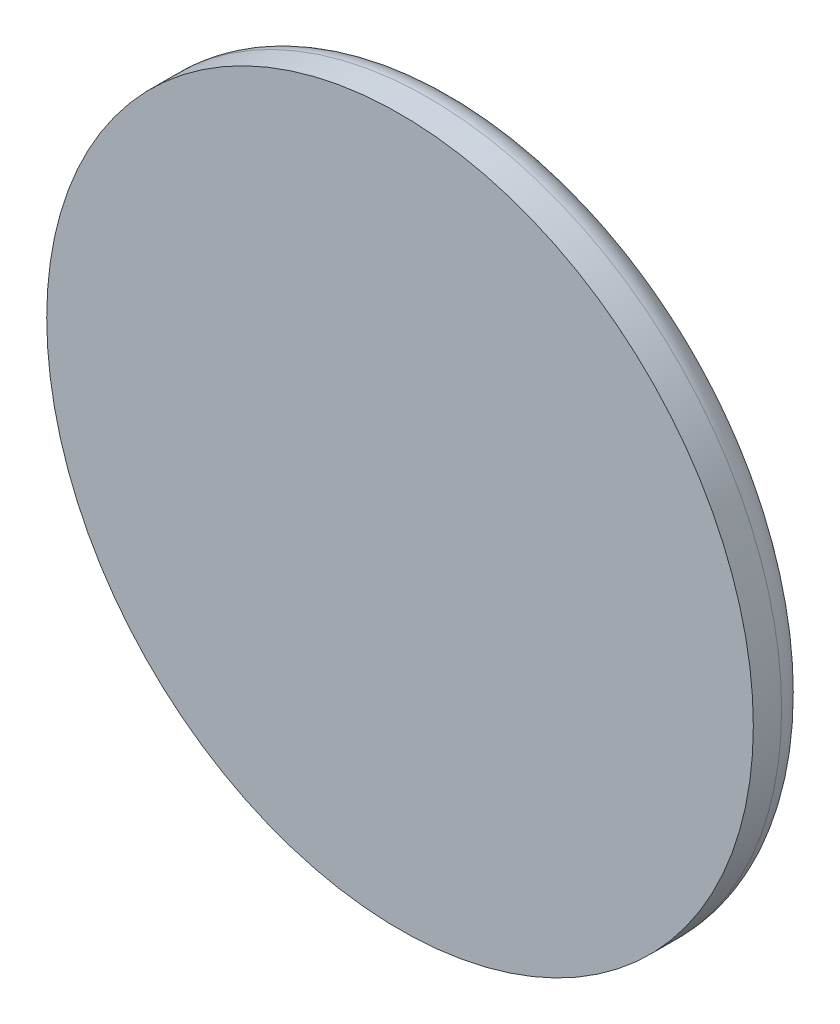
ISO-10303-21;
HEADER;
FILE_DESCRIPTION(('STEP AP214'),'2;1');
FILE_NAME('part.step','',(''),(''),'','','');
FILE_SCHEMA(('AUTOMOTIVE_DESIGN { 1 0 10303 214 1 1 1 1 }'));
ENDSEC;
DATA;
#1=APPLICATION_CONTEXT('core data for automotive mechanical design processes');
#2=APPLICATION_PROTOCOL_DEFINITION('international standard','automotive_design',2000,#1);
#3=PRODUCT_CONTEXT('',#1,'mechanical');
#4=PRODUCT('Part','Part','',(#3));
#5=PRODUCT_RELATED_PRODUCT_CATEGORY('part','',(#4));
#6=PRODUCT_DEFINITION_FORMATION('','',#4);
#7=PRODUCT_DEFINITION_CONTEXT('part definition',#1,'design');
#8=PRODUCT_DEFINITION('design','',#6,#7);
#9=PRODUCT_DEFINITION_SHAPE('','',#8);
#10=(LENGTH_UNIT() NAMED_UNIT(*) SI_UNIT(.MILLI.,.METRE.));
#11=(NAMED_UNIT(*) PLANE_ANGLE_UNIT() SI_UNIT($,.RADIAN.));
#12=(NAMED_UNIT(*) SI_UNIT($,.STERADIAN.) SOLID_ANGLE_UNIT());
#13=UNCERTAINTY_MEASURE_WITH_UNIT(LENGTH_MEASURE(1.E-05),#10,'distance_accuracy_value','');
#14=(GEOMETRIC_REPRESENTATION_CONTEXT(3) GLOBAL_UNCERTAINTY_ASSIGNED_CONTEXT((#13)) GLOBAL_UNIT_ASSIGNED_CONTEXT((#10,
#11,#12)) REPRESENTATION_CONTEXT('',''));
#15=CARTESIAN_POINT('',(0.,0.,0.));
#16=DIRECTION('',(0.,0.,1.));
#17=DIRECTION('',(1.,0.,0.));
#18=AXIS2_PLACEMENT_3D('',#15,#16,#17);
#19=CARTESIAN_POINT('',(0.,0.,-35.));
#20=DIRECTION('',(0.,0.,1.));
#21=DIRECTION('',(1.,0.,0.));
#22=AXIS2_PLACEMENT_3D('',#19,#20,#21);
#23=CYLINDRICAL_SURFACE('',#22,10.);
#24=CARTESIAN_POINT('',(0.,0.,-28.3197640478404));
#25=DIRECTION('',(0.5,0.,-0.866025403784438));
#26=DIRECTION('',(0.866025403784439,0.,0.5));
#27=AXIS2_PLACEMENT_3D('',#24,#25,#26);
#28=ELLIPSE('',#27,11.5470053837925,10.);
#29=CARTESIAN_POINT('',(0.,-10.,-28.3197640478404));
#30=VERTEX_POINT('',#29);
#31=CARTESIAN_POINT('',(2.87499999999999,-9.57780637724527,-26.6598820239202));
#32=VERTEX_POINT('',#31);
#33=EDGE_CURVE('E12',#30,#32,#28,.F.);
#34=ORIENTED_EDGE('',*,*,#33,.F.);
#35=CARTESIAN_POINT('',(0.,0.,-28.3197640478404));
#36=DIRECTION('',(-0.5,0.,-0.866025403784438));
#37=DIRECTION('',(-0.866025403784438,0.,0.5));
#38=AXIS2_PLACEMENT_3D('',#35,#36,#37);
#39=ELLIPSE('',#38,11.5470053837925,10.);
#40=CARTESIAN_POINT('',(-2.87500000000001,-9.57780637724526,-26.6598820239202));
#41=VERTEX_POINT('',#40);
#42=EDGE_CURVE('E215',#41,#30,#39,.F.);
#43=ORIENTED_EDGE('',*,*,#42,.F.);
#44=DIRECTION('',(0.,0.,1.));
#45=VECTOR('',#44,1.);
#46=CARTESIAN_POINT('',(-2.87500000000001,-9.57780637724526,-35.));
#47=LINE('',#46,#45);
#48=CARTESIAN_POINT('',(-2.87500000000001,-9.57780637724526,-23.3401179760798));
#49=VERTEX_POINT('',#48);
#50=EDGE_CURVE('E399',#49,#41,#47,.F.);
#51=ORIENTED_EDGE('',*,*,#50,.F.);
#52=CARTESIAN_POINT('',(0.,0.,-21.6802359521596));
#53=DIRECTION('',(-0.5,0.,0.866025403784438));
#54=DIRECTION('',(0.866025403784439,0.,0.5));
#55=AXIS2_PLACEMENT_3D('',#52,#53,#54);
#56=ELLIPSE('',#55,11.5470053837925,10.);
#57=CARTESIAN_POINT('',(0.,-10.,-21.6802359521596));
#58=VERTEX_POINT('',#57);
#59=EDGE_CURVE('E395',#58,#49,#56,.F.);
#60=ORIENTED_EDGE('',*,*,#59,.F.);
#61=CARTESIAN_POINT('',(0.,0.,-21.6802359521597));
#62=DIRECTION('',(0.5,0.,0.866025403784438));
#63=DIRECTION('',(-0.866025403784438,0.,0.5));
#64=AXIS2_PLACEMENT_3D('',#61,#62,#63);
#65=ELLIPSE('',#64,11.5470053837925,10.);
#66=CARTESIAN_POINT('',(2.87499999999999,-9.57780637724526,-23.3401179760798));
#67=VERTEX_POINT('',#66);
#68=EDGE_CURVE('E398',#67,#58,#65,.F.);
#69=ORIENTED_EDGE('',*,*,#68,.F.);
#70=DIRECTION('',(0.,0.,1.));
#71=VECTOR('',#70,1.);
#72=CARTESIAN_POINT('',(2.87499999999999,-9.57780637724526,-35.));
#73=LINE('',#72,#71);
#74=EDGE_CURVE('E55',#32,#67,#73,.T.);
#75=ORIENTED_EDGE('',*,*,#74,.F.);
#76=EDGE_LOOP('',(#34,#43,#51,#60,#69,#75));
#77=FACE_BOUND('',#76,.T.);
#78=CARTESIAN_POINT('',(0.,10.,-21.36));
#79=CARTESIAN_POINT('',(0.197535349137178,10.0000037889343,-21.3599948221369));
#80=CARTESIAN_POINT('',(0.39503428137334,9.99409517314257,-21.3761306562231));
#81=CARTESIAN_POINT('',(0.78415233082182,9.97111253768298,-21.4400041630462));
#82=CARTESIAN_POINT('',(0.975771911280972,9.95403940006929,-21.4877393392775));
#83=CARTESIAN_POINT('',(1.34746459121127,9.91056661431408,-21.612914879753));
#84=CARTESIAN_POINT('',(1.52755844233505,9.88418431892454,-21.6902999978552));
#85=CARTESIAN_POINT('',(1.87220068295813,9.82473848053595,-21.872306282497));
#86=CARTESIAN_POINT('',(2.03674515732502,9.79167326140606,-21.9769342836714));
#87=CARTESIAN_POINT('',(2.3522596516936,9.72080151000606,-22.214874367687));
#88=CARTESIAN_POINT('',(2.50251784817101,9.68286623157406,-22.349091674614));
#89=CARTESIAN_POINT('',(2.77895839400479,9.60718324289154,-22.6404783326568));
#90=CARTESIAN_POINT('',(2.90513397957141,9.56943558822734,-22.7976541100226));
#91=CARTESIAN_POINT('',(3.13422451321826,9.49692665102151,-23.1372999444331));
#92=CARTESIAN_POINT('',(3.23615612514396,9.46231870483542,-23.3204692401867));
#93=CARTESIAN_POINT('',(3.40745285887733,9.4019983958312,-23.702811139506));
#94=CARTESIAN_POINT('',(3.47683013421217,9.37628271420415,-23.9019777382158));
#95=CARTESIAN_POINT('',(3.57827653394133,9.33802924469546,-24.3024893920733));
#96=CARTESIAN_POINT('',(3.61169796742041,9.32501564688372,-24.5034449904336));
#97=CARTESIAN_POINT('',(3.64451264901038,9.31224293548908,-24.9085010015547));
#98=CARTESIAN_POINT('',(3.64391892742264,9.31247874640935,-25.1126001801398));
#99=CARTESIAN_POINT('',(3.60975848773193,9.32576609219854,-25.506018291931));
#100=CARTESIAN_POINT('',(3.57803567663553,9.33810093386172,-25.6955259465039));
#101=CARTESIAN_POINT('',(3.48555477420691,9.37301046913844,-26.0663168234405));
#102=CARTESIAN_POINT('',(3.42479256494661,9.39558661499572,-26.2475988753803));
#103=CARTESIAN_POINT('',(3.27489332948789,9.44888763065943,-26.6006675101781));
#104=CARTESIAN_POINT('',(3.18525977429469,9.47975339470649,-26.7722210835465));
#105=CARTESIAN_POINT('',(2.98050773776605,9.54610561277792,-27.0984004433119));
#106=CARTESIAN_POINT('',(2.86538082649929,9.58159359363633,-27.2530206049732));
#107=CARTESIAN_POINT('',(2.60435929425257,9.65592202355623,-27.5511950608616));
#108=CARTESIAN_POINT('',(2.45698275184153,9.69483279225514,-27.6934375888777));
#109=CARTESIAN_POINT('',(2.1400092141802,9.76969044506478,-27.9515659421343));
#110=CARTESIAN_POINT('',(1.9704091923845,9.80563692438995,-28.0674481715571));
#111=CARTESIAN_POINT('',(1.61061302211946,9.87115866976639,-28.2709023477188));
#112=CARTESIAN_POINT('',(1.42016468348805,9.90063904606652,-28.3580610246388));
#113=CARTESIAN_POINT('',(1.02597083724377,9.94920783226136,-28.4986744267993));
#114=CARTESIAN_POINT('',(0.822230919356161,9.96830057948553,-28.5521432206461));
#115=CARTESIAN_POINT('',(0.418295411313921,9.99319242214812,-28.621391911473));
#116=CARTESIAN_POINT('',(0.218440993893616,9.99961453824631,-28.6389398256952));
#117=CARTESIAN_POINT('',(-0.181435496219831,10.0003512268405,-28.6409661215697));
#118=CARTESIAN_POINT('',(-0.381457525722825,9.99466830154851,-28.6254513375545));
#119=CARTESIAN_POINT('',(-0.768506652336971,9.97224503919737,-28.5631529381011));
#120=CARTESIAN_POINT('',(-0.955742662014246,9.95590740446292,-28.5175073984021));
#121=CARTESIAN_POINT('',(-1.31978337438635,9.91422045795839,-28.3977208163257));
#122=CARTESIAN_POINT('',(-1.49658671681563,9.88886997405996,-28.3235760675014));
#123=CARTESIAN_POINT('',(-1.8404185321879,9.83077560236646,-28.146572797372));
#124=CARTESIAN_POINT('',(-2.00702108067769,9.79784047798823,-28.0429515644379));
#125=CARTESIAN_POINT('',(-2.32101624131443,9.72824701978391,-27.8108073098548));
#126=CARTESIAN_POINT('',(-2.46840203432452,9.69158737246303,-27.6822754886023));
#127=CARTESIAN_POINT('',(-2.74818467449489,9.61611276019166,-27.3956901648859));
#128=CARTESIAN_POINT('',(-2.87932406011657,9.57728938441707,-27.236408109775));
#129=CARTESIAN_POINT('',(-3.11323546701793,9.50383297041942,-26.8973105929511));
#130=CARTESIAN_POINT('',(-3.21600568971241,9.46920019795586,-26.7174938303733));
#131=CARTESIAN_POINT('',(-3.39017578479961,9.40825637272477,-26.3413893688979));
#132=CARTESIAN_POINT('',(-3.46150715594191,9.38196352616796,-26.1450668025952));
#133=CARTESIAN_POINT('',(-3.56966921007214,9.3413523883247,-25.7419835335568));
#134=CARTESIAN_POINT('',(-3.60651957485373,9.32702726634988,-25.5352288566041));
#135=CARTESIAN_POINT('',(-3.64297125160169,9.31284628457146,-25.130685982168));
#136=CARTESIAN_POINT('',(-3.64470081882839,9.31216375122628,-24.9331167897363));
#137=CARTESIAN_POINT('',(-3.6162559058204,9.32324629104493,-24.540663252245));
#138=CARTESIAN_POINT('',(-3.5860841039767,9.33501031921424,-24.34577868318));
#139=CARTESIAN_POINT('',(-3.49631195353495,9.36899113809255,-23.9695573511427));
#140=CARTESIAN_POINT('',(-3.43753051400336,9.39091629172975,-23.7879966412434));
#141=CARTESIAN_POINT('',(-3.29291148300164,9.44259507838883,-23.4371969626932));
#142=CARTESIAN_POINT('',(-3.20706724968832,9.47235063287783,-23.2679610313965));
#143=CARTESIAN_POINT('',(-3.00575414076358,9.53819575281279,-22.9373927196332));
#144=CARTESIAN_POINT('',(-2.88901518093742,9.57452818220107,-22.7768826997879));
#145=CARTESIAN_POINT('',(-2.631240909882,9.64855098529571,-22.477048115587));
#146=CARTESIAN_POINT('',(-2.49019810823043,9.68624177480681,-22.3377301075874));
#147=CARTESIAN_POINT('',(-2.17941659168273,9.76098820654276,-22.0771832085807));
#148=CARTESIAN_POINT('',(-2.00859889358517,9.79791882808294,-21.9572000557293));
#149=CARTESIAN_POINT('',(-1.64794192207384,9.86498302453241,-21.7477138237944));
#150=CARTESIAN_POINT('',(-1.45810300486663,9.89511672669189,-21.6582101740654));
#151=CARTESIAN_POINT('',(-1.06086440820831,9.94561952425485,-21.5114737365863));
#152=CARTESIAN_POINT('',(-0.85319999944209,9.96579262824357,-21.4548850510971));
#153=CARTESIAN_POINT('',(-0.430340474617686,9.99297797346462,-21.3791590537837));
#154=CARTESIAN_POINT('',(-0.215148636971217,9.99999587322448,-21.3600056395485));
#155=CARTESIAN_POINT('',(0.,10.,-21.36));
#156=B_SPLINE_CURVE_WITH_KNOTS('',3,(#78,#79,#80,#81,#82,#83,#84,#85,#86,#87,#88,#89,#90,#91,
#92,#93,#94,#95,#96,#97,#98,#99,#100,#101,#102,#103,#104,#105,#106,#107,#108,#109,#110,#111,
#112,#113,#114,#115,#116,#117,#118,#119,#120,#121,#122,#123,#124,#125,#126,#127,#128,#129,#130,
#131,#132,#133,#134,#135,#136,#137,#138,#139,#140,#141,#142,#143,#144,#145,#146,#147,#148,#149,
#150,#151,#152,#153,#154,#155),.UNSPECIFIED.,.T.,.F.,(4,2,2,2,2,2,2,2,2,2,2,2,2,2,2,2,2,2,2,2,2,
2,2,2,2,2,2,2,2,2,2,2,2,2,2,2,2,2,4),(0.,0.59181294969755,1.18357914879932,1.77424804221876,
2.36506526437862,2.97738126281261,3.5898689827412,4.22407284169865,4.85803974425795,
5.46722599623528,6.07617888672007,6.65111229937602,7.22612726459124,7.8116126495696,
8.39729192787197,9.01988681184698,9.64256657334584,10.2738495775608,10.9048687883885,
11.5040002895537,12.1030079573097,12.6805939570248,13.2582550997607,13.8524880000157,
14.4469311954273,15.0738249546886,15.7007584494552,16.3290512796466,16.9569852604833,
17.5467459261199,18.1364570802694,18.7102015476004,19.2840869350202,19.8867611022042,
20.4896213463341,21.1224924477324,21.7553516996954,22.4002112371801,23.0447933336277),.UNSPECIFIED.);
#157=CARTESIAN_POINT('',(0.,10.,-21.36));
#158=VERTEX_POINT('',#157);
#159=EDGE_CURVE('E176',#158,#158,#156,.T.);
#160=ORIENTED_EDGE('',*,*,#159,.F.);
#161=EDGE_LOOP('',(#160));
#162=FACE_BOUND('',#161,.T.);
#163=CARTESIAN_POINT('',(0.,0.,-33.));
#164=DIRECTION('',(0.,0.,1.));
#165=DIRECTION('',(1.,0.,0.));
#166=AXIS2_PLACEMENT_3D('',#163,#164,#165);
#167=CIRCLE('',#166,10.);
#168=CARTESIAN_POINT('',(10.,0.,-33.));
#169=VERTEX_POINT('',#168);
#170=EDGE_CURVE('E170',#169,#169,#167,.T.);
#171=ORIENTED_EDGE('',*,*,#170,.T.);
#172=EDGE_LOOP('',(#171));
#173=FACE_BOUND('',#172,.T.);
#174=CARTESIAN_POINT('',(0.,0.,-15.));
#175=DIRECTION('',(0.,0.,1.));
#176=DIRECTION('',(1.,0.,0.));
#177=AXIS2_PLACEMENT_3D('',#174,#175,#176);
#178=CIRCLE('',#177,10.);
#179=CARTESIAN_POINT('',(10.,0.,-15.));
#180=VERTEX_POINT('',#179);
#181=EDGE_CURVE('E167',#180,#180,#178,.F.);
#182=ORIENTED_EDGE('',*,*,#181,.T.);
#183=EDGE_LOOP('',(#182));
#184=FACE_BOUND('',#183,.T.);
#185=ADVANCED_FACE('F47',(#77,#162,#173,#184),#23,.T.);
#186=CARTESIAN_POINT('',(0.,10.,-25.));
#187=DIRECTION('',(0.,1.,0.));
#188=DIRECTION('',(0.,0.,1.));
#189=AXIS2_PLACEMENT_3D('',#186,#187,#188);
#190=CYLINDRICAL_SURFACE('',#189,1.55);
#191=CARTESIAN_POINT('',(0.,-5.,-23.45));
#192=CARTESIAN_POINT('',(-0.0848984604279451,-4.99999951036779,-23.4500006542647));
#193=CARTESIAN_POINT('',(-0.169803668342379,-4.99781721187509,-23.4569982543485));
#194=CARTESIAN_POINT('',(-0.337133220777892,-4.98932527207252,-23.4847318111606));
#195=CARTESIAN_POINT('',(-0.419556962786359,-4.98301463670185,-23.5054710767553));
#196=CARTESIAN_POINT('',(-0.579486364639224,-4.96695583698883,-23.5599229120073));
#197=CARTESIAN_POINT('',(-0.656999353904879,-4.95721294513531,-23.5936155903835));
#198=CARTESIAN_POINT('',(-0.805275561821529,-4.93529695244566,-23.6729338298643));
#199=CARTESIAN_POINT('',(-0.876037747534826,-4.92312348058601,-23.7185612131094));
#200=CARTESIAN_POINT('',(-1.01095832875082,-4.89722526714626,-23.821916254237));
#201=CARTESIAN_POINT('',(-1.07488231229008,-4.88346713124333,-23.8799415181796));
#202=CARTESIAN_POINT('',(-1.19226552074318,-4.85614480692875,-24.005811404524));
#203=CARTESIAN_POINT('',(-1.24572283638974,-4.84258065431989,-24.0736578145222));
#204=CARTESIAN_POINT('',(-1.34191867293835,-4.81682477265869,-24.2192640819453));
#205=CARTESIAN_POINT('',(-1.38436572096407,-4.8046743175935,-24.2972244952041));
#206=CARTESIAN_POINT('',(-1.45544961933946,-4.78362317675618,-24.4596146802643));
#207=CARTESIAN_POINT('',(-1.48409004182491,-4.77472165054594,-24.5440427721494));
#208=CARTESIAN_POINT('',(-1.52589247703498,-4.76152527274791,-24.7143291167986));
#209=CARTESIAN_POINT('',(-1.53948878696477,-4.75710149871766,-24.8000704898974));
#210=CARTESIAN_POINT('',(-1.55217372132493,-4.75297857101368,-24.9727226946374));
#211=CARTESIAN_POINT('',(-1.55126613235545,-4.75327818418307,-25.0596332151237));
#212=CARTESIAN_POINT('',(-1.53530900350483,-4.75845428577028,-25.2285765807295));
#213=CARTESIAN_POINT('',(-1.52080991327079,-4.76315261879823,-25.3106677916853));
#214=CARTESIAN_POINT('',(-1.4789731992563,-4.77630760142625,-25.4711897901275));
#215=CARTESIAN_POINT('',(-1.4516342308496,-4.78476464464349,-25.5496201932984));
#216=CARTESIAN_POINT('',(-1.38450171199553,-4.80462183036645,-25.7019126215418));
#217=CARTESIAN_POINT('',(-1.34453416997655,-4.81606267263906,-25.7756924144823));
#218=CARTESIAN_POINT('',(-1.25339989003565,-4.84057952939702,-25.9156794020436));
#219=CARTESIAN_POINT('',(-1.2022302820293,-4.85365596256883,-25.9818846493567));
#220=CARTESIAN_POINT('',(-1.08743667269011,-4.88068691421537,-26.1079572108127));
#221=CARTESIAN_POINT('',(-1.0233577687063,-4.89465453918908,-26.1674082617371));
#222=CARTESIAN_POINT('',(-0.885965810322424,-4.92137742235268,-26.2748209393398));
#223=CARTESIAN_POINT('',(-0.812652093991192,-4.93413259352141,-26.3227817417063));
#224=CARTESIAN_POINT('',(-0.658078685457123,-4.95712370655291,-26.4061285474261));
#225=CARTESIAN_POINT('',(-0.576763076811212,-4.96733986015102,-26.4414166760647));
#226=CARTESIAN_POINT('',(-0.408959843162277,-4.98395906682503,-26.4976903870365));
#227=CARTESIAN_POINT('',(-0.322473770976233,-4.99036325845885,-26.5186802402537));
#228=CARTESIAN_POINT('',(-0.150319074279245,-4.99845438764376,-26.5450557539543));
#229=CARTESIAN_POINT('',(-0.0647446827565126,-5.00031163429244,-26.5510050614588));
#230=CARTESIAN_POINT('',(0.106188109515853,-4.99960248750333,-26.548717900843));
#231=CARTESIAN_POINT('',(0.191546539500479,-4.99703672887713,-26.5404834684434));
#232=CARTESIAN_POINT('',(0.35745979733322,-4.98788169118652,-26.5105157457748));
#233=CARTESIAN_POINT('',(0.438081008945537,-4.9813920802339,-26.489116618391));
#234=CARTESIAN_POINT('',(0.594567232233526,-4.96514689632701,-26.4338335369529));
#235=CARTESIAN_POINT('',(0.670431658053575,-4.95539092201505,-26.3999480485729));
#236=CARTESIAN_POINT('',(0.81728685869863,-4.93332471675189,-26.3197389994806));
#237=CARTESIAN_POINT('',(0.888115813244314,-4.92095852072226,-26.2731349792961));
#238=CARTESIAN_POINT('',(1.02113752532934,-4.89508710334594,-26.169149134216));
#239=CARTESIAN_POINT('',(1.08332796844852,-4.88158157830333,-26.1117644306223));
#240=CARTESIAN_POINT('',(1.19982105818673,-4.85429209347264,-25.9851955512319));
#241=CARTESIAN_POINT('',(1.25372210260317,-4.84051777932991,-25.9156388310857));
#242=CARTESIAN_POINT('',(1.34912131846231,-4.8148023151216,-25.7681682022379));
#243=CARTESIAN_POINT('',(1.39061971542026,-4.80286113172644,-25.690254445526));
#244=CARTESIAN_POINT('',(1.45977182503441,-4.78229760560468,-25.5284613620983));
#245=CARTESIAN_POINT('',(1.48748156983816,-4.77366186434556,-25.4446077875814));
#246=CARTESIAN_POINT('',(1.5282920920436,-4.76075522394672,-25.2731033137341));
#247=CARTESIAN_POINT('',(1.54139831446475,-4.75648269800308,-25.1854538424006));
#248=CARTESIAN_POINT('',(1.55224290370566,-4.75295389387883,-25.0130385431529));
#249=CARTESIAN_POINT('',(1.550639237088,-4.75348283682889,-24.9283179784881));
#250=CARTESIAN_POINT('',(1.53369431627937,-4.75897670483197,-24.7604160072565));
#251=CARTESIAN_POINT('',(1.51835368394045,-4.76394142908372,-24.6772345311914));
#252=CARTESIAN_POINT('',(1.47480761637235,-4.77759858050366,-24.515927968377));
#253=CARTESIAN_POINT('',(1.4467876029516,-4.78623717549533,-24.4377479249056));
#254=CARTESIAN_POINT('',(1.3788237972399,-4.80625573394826,-24.2871363091867));
#255=CARTESIAN_POINT('',(1.33887760753707,-4.81763624850405,-24.214705896445));
#256=CARTESIAN_POINT('',(1.24639244761276,-4.84240420312915,-24.074624987861));
#257=CARTESIAN_POINT('',(1.1934270921622,-4.85585213290257,-24.0072667212592));
#258=CARTESIAN_POINT('',(1.07716085006952,-4.88295838962449,-23.8821811239895));
#259=CARTESIAN_POINT('',(1.01385721621445,-4.89661677162082,-23.8244563615196));
#260=CARTESIAN_POINT('',(0.876277521882477,-4.92312838994157,-23.7184319225058));
#261=CARTESIAN_POINT('',(0.801715529938178,-4.93594196348224,-23.6704922707534));
#262=CARTESIAN_POINT('',(0.64519347414163,-4.9588270762312,-23.5878924499977));
#263=CARTESIAN_POINT('',(0.563236449212157,-4.96889973502192,-23.5532268565719));
#264=CARTESIAN_POINT('',(0.401796551606229,-4.98442975017195,-23.5007973275155));
#265=CARTESIAN_POINT('',(0.322744010256349,-4.99021839691233,-23.4818025365935));
#266=CARTESIAN_POINT('',(0.162462753769385,-4.99800338668134,-23.4564047863536));
#267=CARTESIAN_POINT('',(0.0812344657079262,-5.00000046850097,-23.4499993739717));
#268=CARTESIAN_POINT('',(0.,-5.,-23.45));
#269=B_SPLINE_CURVE_WITH_KNOTS('',3,(#191,#192,#193,#194,#195,#196,#197,#198,#199,#200,#201,
#202,#203,#204,#205,#206,#207,#208,#209,#210,#211,#212,#213,#214,#215,#216,#217,#218,#219,#220,
#221,#222,#223,#224,#225,#226,#227,#228,#229,#230,#231,#232,#233,#234,#235,#236,#237,#238,#239,
#240,#241,#242,#243,#244,#245,#246,#247,#248,#249,#250,#251,#252,#253,#254,#255,#256,#257,#258,
#259,#260,#261,#262,#263,#264,#265,#266,#267,#268),.UNSPECIFIED.,.T.,.F.,(4,2,2,2,2,2,2,2,2,2,2,
2,2,2,2,2,2,2,2,2,2,2,2,2,2,2,2,2,2,2,2,2,2,2,2,2,2,2,4),(0.,0.254396830193011,
0.508854939067414,0.762923852397209,1.01703157856677,1.27811016261802,1.53923632679228,
1.80669687701853,2.07408819100383,2.33354085793618,2.59292578946426,2.84223973015721,
3.09157978549387,3.34451706133851,3.59751921831481,3.86184447125796,4.12618868125026,
4.39253268700392,4.65879710108144,4.91492451484355,5.17101517099383,5.42085927295126,
5.67073408602785,5.92663973952147,6.18261382326728,6.44855856503467,6.71449847087905,
6.97934868222449,7.24410010934583,7.49706915491489,7.75002674952946,7.99939903495252,
8.24882148323297,8.50786697268708,8.76698141119865,9.03437391807996,9.30165703853481,
9.54512221360273,9.78853994431715),.UNSPECIFIED.);
#270=CARTESIAN_POINT('',(0.,-5.,-23.45));
#271=VERTEX_POINT('',#270);
#272=EDGE_CURVE('E152',#271,#271,#269,.T.);
#273=ORIENTED_EDGE('',*,*,#272,.F.);
#274=EDGE_LOOP('',(#273));
#275=FACE_BOUND('',#274,.T.);
#276=CARTESIAN_POINT('',(0.,-7.5,-25.));
#277=DIRECTION('',(0.,-1.,0.));
#278=DIRECTION('',(0.,0.,-1.));
#279=AXIS2_PLACEMENT_3D('',#276,#277,#278);
#280=CIRCLE('',#279,1.55);
#281=CARTESIAN_POINT('',(0.,-7.5,-26.55));
#282=VERTEX_POINT('',#281);
#283=EDGE_CURVE('E131',#282,#282,#280,.F.);
#284=ORIENTED_EDGE('',*,*,#283,.F.);
#285=EDGE_LOOP('',(#284));
#286=FACE_BOUND('',#285,.T.);
#287=ADVANCED_FACE('F191',(#275,#286),#190,.F.);
#288=CARTESIAN_POINT('',(0.,0.,-10.));
#289=DIRECTION('',(0.,0.,1.));
#290=DIRECTION('',(1.,0.,0.));
#291=AXIS2_PLACEMENT_3D('',#288,#289,#290);
#292=CYLINDRICAL_SURFACE('',#291,62.5);
#293=CARTESIAN_POINT('',(0.,0.,-5.));
#294=DIRECTION('',(0.,0.,1.));
#295=DIRECTION('',(1.,0.,0.));
#296=AXIS2_PLACEMENT_3D('',#293,#294,#295);
#297=CIRCLE('',#296,62.5);
#298=CARTESIAN_POINT('',(62.5,0.,-5.));
#299=VERTEX_POINT('',#298);
#300=EDGE_CURVE('E156',#299,#299,#297,.T.);
#301=ORIENTED_EDGE('',*,*,#300,.T.);
#302=EDGE_LOOP('',(#301));
#303=FACE_BOUND('',#302,.T.);
#304=CARTESIAN_POINT('',(0.,0.,0.));
#305=DIRECTION('',(0.,0.,1.));
#306=DIRECTION('',(1.,0.,0.));
#307=AXIS2_PLACEMENT_3D('',#304,#305,#306);
#308=CIRCLE('',#307,62.5);
#309=CARTESIAN_POINT('',(62.5,0.,0.));
#310=VERTEX_POINT('',#309);
#311=EDGE_CURVE('E151',#310,#310,#308,.T.);
#312=ORIENTED_EDGE('',*,*,#311,.F.);
#313=EDGE_LOOP('',(#312));
#314=FACE_BOUND('',#313,.T.);
#315=ADVANCED_FACE('F195',(#303,#314),#292,.T.);
#316=CARTESIAN_POINT('',(0.,0.,-10.));
#317=DIRECTION('',(0.,0.,1.));
#318=DIRECTION('',(1.,0.,0.));
#319=AXIS2_PLACEMENT_3D('',#316,#317,#318);
#320=PLANE('',#319);
#321=CARTESIAN_POINT('',(0.,0.,-10.));
#322=DIRECTION('',(0.,0.,1.));
#323=DIRECTION('',(1.,0.,0.));
#324=AXIS2_PLACEMENT_3D('',#321,#322,#323);
#325=CIRCLE('',#324,57.5);
#326=CARTESIAN_POINT('',(57.5,0.,-10.));
#327=VERTEX_POINT('',#326);
#328=EDGE_CURVE('E164',#327,#327,#325,.F.);
#329=ORIENTED_EDGE('',*,*,#328,.T.);
#330=EDGE_LOOP('',(#329));
#331=FACE_BOUND('',#330,.T.);
#332=CARTESIAN_POINT('',(0.,0.,-10.));
#333=DIRECTION('',(0.,0.,1.));
#334=DIRECTION('',(1.,0.,0.));
#335=AXIS2_PLACEMENT_3D('',#332,#333,#334);
#336=CIRCLE('',#335,15.);
#337=CARTESIAN_POINT('',(15.,0.,-10.));
#338=VERTEX_POINT('',#337);
#339=EDGE_CURVE('E161',#338,#338,#336,.T.);
#340=ORIENTED_EDGE('',*,*,#339,.T.);
#341=EDGE_LOOP('',(#340));
#342=FACE_BOUND('',#341,.T.);
#343=ADVANCED_FACE('F222',(#331,#342),#320,.F.);
#344=CARTESIAN_POINT('',(0.,0.,0.));
#345=DIRECTION('',(0.,0.,1.));
#346=DIRECTION('',(1.,0.,0.));
#347=AXIS2_PLACEMENT_3D('',#344,#345,#346);
#348=PLANE('',#347);
#349=ORIENTED_EDGE('',*,*,#311,.T.);
#350=EDGE_LOOP('',(#349));
#351=FACE_BOUND('',#350,.T.);
#352=ADVANCED_FACE('F225',(#351),#348,.T.);
#353=CARTESIAN_POINT('',(0.,0.,-35.));
#354=DIRECTION('',(0.,0.,1.));
#355=DIRECTION('',(1.,0.,0.));
#356=AXIS2_PLACEMENT_3D('',#353,#354,#355);
#357=PLANE('',#356);
#358=CARTESIAN_POINT('',(0.,0.,-35.));
#359=DIRECTION('',(0.,0.,1.));
#360=DIRECTION('',(1.,0.,0.));
#361=AXIS2_PLACEMENT_3D('',#358,#359,#360);
#362=CIRCLE('',#361,8.00000000000002);
#363=CARTESIAN_POINT('',(8.00000000000002,0.,-35.));
#364=VERTEX_POINT('',#363);
#365=EDGE_CURVE('E173',#364,#364,#362,.F.);
#366=ORIENTED_EDGE('',*,*,#365,.T.);
#367=EDGE_LOOP('',(#366));
#368=FACE_BOUND('',#367,.T.);
#369=CARTESIAN_POINT('',(0.,0.,-35.));
#370=DIRECTION('',(0.,0.,1.));
#371=DIRECTION('',(1.,0.,0.));
#372=AXIS2_PLACEMENT_3D('',#369,#370,#371);
#373=CIRCLE('',#372,5.);
#374=CARTESIAN_POINT('',(5.,0.,-35.));
#375=VERTEX_POINT('',#374);
#376=EDGE_CURVE('E148',#375,#375,#373,.T.);
#377=ORIENTED_EDGE('',*,*,#376,.T.);
#378=EDGE_LOOP('',(#377));
#379=FACE_BOUND('',#378,.T.);
#380=ADVANCED_FACE('F221',(#368,#379),#357,.F.);
#381=CARTESIAN_POINT('',(0.,0.,-35.));
#382=DIRECTION('',(0.,0.,1.));
#383=DIRECTION('',(1.,0.,0.));
#384=AXIS2_PLACEMENT_3D('',#381,#382,#383);
#385=CYLINDRICAL_SURFACE('',#384,5.);
#386=ORIENTED_EDGE('',*,*,#272,.T.);
#387=EDGE_LOOP('',(#386));
#388=FACE_BOUND('',#387,.T.);
#389=CARTESIAN_POINT('',(0.,5.,-23.45));
#390=CARTESIAN_POINT('',(0.0848984604279462,4.99999951036779,-23.4500006542647));
#391=CARTESIAN_POINT('',(0.16980366834238,4.99781721187509,-23.4569982543485));
#392=CARTESIAN_POINT('',(0.337133220777893,4.98932527207252,-23.4847318111606));
#393=CARTESIAN_POINT('',(0.41955696278636,4.98301463670185,-23.5054710767553));
#394=CARTESIAN_POINT('',(0.579486364639226,4.96695583698883,-23.5599229120073));
#395=CARTESIAN_POINT('',(0.65699935390488,4.95721294513531,-23.5936155903835));
#396=CARTESIAN_POINT('',(0.80527556182153,4.93529695244566,-23.6729338298643));
#397=CARTESIAN_POINT('',(0.876037747534827,4.92312348058601,-23.7185612131094));
#398=CARTESIAN_POINT('',(1.01095832875082,4.89722526714626,-23.821916254237));
#399=CARTESIAN_POINT('',(1.07488231229008,4.88346713124333,-23.8799415181796));
#400=CARTESIAN_POINT('',(1.19226552074319,4.85614480692875,-24.005811404524));
#401=CARTESIAN_POINT('',(1.24572283638974,4.84258065431989,-24.0736578145222));
#402=CARTESIAN_POINT('',(1.34191867293835,4.81682477265869,-24.2192640819453));
#403=CARTESIAN_POINT('',(1.38436572096407,4.8046743175935,-24.2972244952041));
#404=CARTESIAN_POINT('',(1.45544961933946,4.78362317675618,-24.4596146802643));
#405=CARTESIAN_POINT('',(1.48409004182491,4.77472165054594,-24.5440427721494));
#406=CARTESIAN_POINT('',(1.52589247703498,4.76152527274791,-24.7143291167986));
#407=CARTESIAN_POINT('',(1.53948878696478,4.75710149871766,-24.8000704898974));
#408=CARTESIAN_POINT('',(1.55217372132493,4.75297857101368,-24.9727226946374));
#409=CARTESIAN_POINT('',(1.55126613235545,4.75327818418307,-25.0596332151237));
#410=CARTESIAN_POINT('',(1.53530900350483,4.75845428577028,-25.2285765807295));
#411=CARTESIAN_POINT('',(1.52080991327079,4.76315261879823,-25.3106677916853));
#412=CARTESIAN_POINT('',(1.4789731992563,4.77630760142625,-25.4711897901275));
#413=CARTESIAN_POINT('',(1.45163423084961,4.78476464464349,-25.5496201932984));
#414=CARTESIAN_POINT('',(1.38450171199553,4.80462183036645,-25.7019126215418));
#415=CARTESIAN_POINT('',(1.34453416997655,4.81606267263906,-25.7756924144823));
#416=CARTESIAN_POINT('',(1.25339989003565,4.84057952939702,-25.9156794020436));
#417=CARTESIAN_POINT('',(1.2022302820293,4.85365596256883,-25.9818846493567));
#418=CARTESIAN_POINT('',(1.08743667269011,4.88068691421537,-26.1079572108127));
#419=CARTESIAN_POINT('',(1.0233577687063,4.89465453918908,-26.1674082617371));
#420=CARTESIAN_POINT('',(0.885965810322422,4.92137742235268,-26.2748209393398));
#421=CARTESIAN_POINT('',(0.812652093991192,4.93413259352141,-26.3227817417063));
#422=CARTESIAN_POINT('',(0.658078685457124,4.95712370655291,-26.4061285474261));
#423=CARTESIAN_POINT('',(0.576763076811213,4.96733986015102,-26.4414166760647));
#424=CARTESIAN_POINT('',(0.408959843162279,4.98395906682503,-26.4976903870365));
#425=CARTESIAN_POINT('',(0.322473770976234,4.99036325845885,-26.5186802402537));
#426=CARTESIAN_POINT('',(0.150319074279246,4.99845438764376,-26.5450557539543));
#427=CARTESIAN_POINT('',(0.064744682756514,5.00031163429244,-26.5510050614588));
#428=CARTESIAN_POINT('',(-0.106188109515851,4.99960248750333,-26.548717900843));
#429=CARTESIAN_POINT('',(-0.191546539500477,4.99703672887713,-26.5404834684434));
#430=CARTESIAN_POINT('',(-0.357459797333218,4.98788169118652,-26.5105157457748));
#431=CARTESIAN_POINT('',(-0.438081008945534,4.9813920802339,-26.489116618391));
#432=CARTESIAN_POINT('',(-0.594567232233523,4.96514689632701,-26.4338335369529));
#433=CARTESIAN_POINT('',(-0.670431658053573,4.95539092201505,-26.3999480485729));
#434=CARTESIAN_POINT('',(-0.817286858698629,4.93332471675189,-26.3197389994806));
#435=CARTESIAN_POINT('',(-0.888115813244313,4.92095852072226,-26.2731349792961));
#436=CARTESIAN_POINT('',(-1.02113752532934,4.89508710334594,-26.169149134216));
#437=CARTESIAN_POINT('',(-1.08332796844852,4.88158157830333,-26.1117644306223));
#438=CARTESIAN_POINT('',(-1.19982105818673,4.85429209347264,-25.9851955512319));
#439=CARTESIAN_POINT('',(-1.25372210260317,4.84051777932991,-25.9156388310857));
#440=CARTESIAN_POINT('',(-1.34912131846231,4.8148023151216,-25.7681682022379));
#441=CARTESIAN_POINT('',(-1.39061971542026,4.80286113172644,-25.690254445526));
#442=CARTESIAN_POINT('',(-1.45977182503441,4.78229760560468,-25.5284613620983));
#443=CARTESIAN_POINT('',(-1.48748156983816,4.77366186434556,-25.4446077875814));
#444=CARTESIAN_POINT('',(-1.5282920920436,4.76075522394672,-25.2731033137341));
#445=CARTESIAN_POINT('',(-1.54139831446475,4.75648269800308,-25.1854538424006));
#446=CARTESIAN_POINT('',(-1.55224290370566,4.75295389387883,-25.0130385431529));
#447=CARTESIAN_POINT('',(-1.550639237088,4.75348283682889,-24.9283179784881));
#448=CARTESIAN_POINT('',(-1.53369431627937,4.75897670483197,-24.7604160072565));
#449=CARTESIAN_POINT('',(-1.51835368394045,4.76394142908372,-24.6772345311914));
#450=CARTESIAN_POINT('',(-1.47480761637235,4.77759858050366,-24.515927968377));
#451=CARTESIAN_POINT('',(-1.4467876029516,4.78623717549533,-24.4377479249056));
#452=CARTESIAN_POINT('',(-1.3788237972399,4.80625573394826,-24.2871363091867));
#453=CARTESIAN_POINT('',(-1.33887760753707,4.81763624850405,-24.214705896445));
#454=CARTESIAN_POINT('',(-1.24639244761276,4.84240420312915,-24.074624987861));
#455=CARTESIAN_POINT('',(-1.1934270921622,4.85585213290257,-24.0072667212592));
#456=CARTESIAN_POINT('',(-1.07716085006952,4.88295838962449,-23.8821811239895));
#457=CARTESIAN_POINT('',(-1.01385721621445,4.89661677162082,-23.8244563615196));
#458=CARTESIAN_POINT('',(-0.876277521882476,4.92312838994157,-23.7184319225058));
#459=CARTESIAN_POINT('',(-0.801715529938177,4.93594196348224,-23.6704922707534));
#460=CARTESIAN_POINT('',(-0.645193474141629,4.9588270762312,-23.5878924499977));
#461=CARTESIAN_POINT('',(-0.563236449212157,4.96889973502192,-23.5532268565719));
#462=CARTESIAN_POINT('',(-0.401796551606228,4.98442975017195,-23.5007973275155));
#463=CARTESIAN_POINT('',(-0.322744010256348,4.99021839691233,-23.4818025365935));
#464=CARTESIAN_POINT('',(-0.162462753769384,4.99800338668134,-23.4564047863536));
#465=CARTESIAN_POINT('',(-0.0812344657079251,5.00000046850097,-23.4499993739717));
#466=CARTESIAN_POINT('',(0.,5.,-23.45));
#467=B_SPLINE_CURVE_WITH_KNOTS('',3,(#389,#390,#391,#392,#393,#394,#395,#396,#397,#398,#399,
#400,#401,#402,#403,#404,#405,#406,#407,#408,#409,#410,#411,#412,#413,#414,#415,#416,#417,#418,
#419,#420,#421,#422,#423,#424,#425,#426,#427,#428,#429,#430,#431,#432,#433,#434,#435,#436,#437,
#438,#439,#440,#441,#442,#443,#444,#445,#446,#447,#448,#449,#450,#451,#452,#453,#454,#455,#456,
#457,#458,#459,#460,#461,#462,#463,#464,#465,#466),.UNSPECIFIED.,.T.,.F.,(4,2,2,2,2,2,2,2,2,2,2,
2,2,2,2,2,2,2,2,2,2,2,2,2,2,2,2,2,2,2,2,2,2,2,2,2,2,2,4),(0.,0.254396830193011,
0.508854939067414,0.762923852397209,1.01703157856677,1.27811016261802,1.53923632679228,
1.80669687701853,2.07408819100383,2.33354085793618,2.59292578946426,2.84223973015721,
3.09157978549387,3.34451706133851,3.59751921831481,3.86184447125796,4.12618868125026,
4.39253268700392,4.65879710108144,4.91492451484355,5.17101517099383,5.42085927295126,
5.67073408602786,5.92663973952148,6.18261382326728,6.44855856503468,6.71449847087905,
6.9793486822245,7.24410010934584,7.49706915491489,7.75002674952946,7.99939903495252,
8.24882148323297,8.50786697268708,8.76698141119865,9.03437391807996,9.30165703853481,
9.54512221360273,9.78853994431715),.UNSPECIFIED.);
#468=CARTESIAN_POINT('',(0.,5.,-23.45));
#469=VERTEX_POINT('',#468);
#470=EDGE_CURVE('E147',#469,#469,#467,.T.);
#471=ORIENTED_EDGE('',*,*,#470,.T.);
#472=EDGE_LOOP('',(#471));
#473=FACE_BOUND('',#472,.T.);
#474=ORIENTED_EDGE('',*,*,#376,.F.);
#475=EDGE_LOOP('',(#474));
#476=FACE_BOUND('',#475,.T.);
#477=CARTESIAN_POINT('',(0.,0.,-10.));
#478=DIRECTION('',(0.,0.,1.));
#479=DIRECTION('',(1.,0.,0.));
#480=AXIS2_PLACEMENT_3D('',#477,#478,#479);
#481=CIRCLE('',#480,5.);
#482=CARTESIAN_POINT('',(5.,0.,-10.));
#483=VERTEX_POINT('',#482);
#484=EDGE_CURVE('E153',#483,#483,#481,.T.);
#485=ORIENTED_EDGE('',*,*,#484,.T.);
#486=EDGE_LOOP('',(#485));
#487=FACE_BOUND('',#486,.T.);
#488=ADVANCED_FACE('F188',(#388,#473,#476,#487),#385,.F.);
#489=ORIENTED_EDGE('',*,*,#484,.F.);
#490=EDGE_LOOP('',(#489));
#491=FACE_BOUND('',#490,.T.);
#492=ADVANCED_FACE('F227',(#491),#320,.F.);
#493=CARTESIAN_POINT('',(0.,0.,-5.));
#494=DIRECTION('',(0.,0.,1.));
#495=DIRECTION('',(1.,0.,0.));
#496=AXIS2_PLACEMENT_3D('',#493,#494,#495);
#497=TOROIDAL_SURFACE('',#496,57.5,5.);
#498=ORIENTED_EDGE('',*,*,#328,.F.);
#499=EDGE_LOOP('',(#498));
#500=FACE_BOUND('',#499,.T.);
#501=ORIENTED_EDGE('',*,*,#300,.F.);
#502=EDGE_LOOP('',(#501));
#503=FACE_BOUND('',#502,.T.);
#504=ADVANCED_FACE('F234',(#500,#503),#497,.T.);
#505=CARTESIAN_POINT('',(0.,0.,-15.));
#506=DIRECTION('',(0.,0.,1.));
#507=DIRECTION('',(1.,0.,0.));
#508=AXIS2_PLACEMENT_3D('',#505,#506,#507);
#509=TOROIDAL_SURFACE('',#508,15.,5.);
#510=ORIENTED_EDGE('',*,*,#181,.F.);
#511=EDGE_LOOP('',(#510));
#512=FACE_BOUND('',#511,.T.);
#513=ORIENTED_EDGE('',*,*,#339,.F.);
#514=EDGE_LOOP('',(#513));
#515=FACE_BOUND('',#514,.T.);
#516=ADVANCED_FACE('F236',(#512,#515),#509,.F.);
#517=CARTESIAN_POINT('',(0.,0.,-33.));
#518=DIRECTION('',(0.,0.,1.));
#519=DIRECTION('',(1.,0.,0.));
#520=AXIS2_PLACEMENT_3D('',#517,#518,#519);
#521=CONICAL_SURFACE('',#520,10.,0.78539816339745);
#522=ORIENTED_EDGE('',*,*,#365,.F.);
#523=EDGE_LOOP('',(#522));
#524=FACE_BOUND('',#523,.T.);
#525=ORIENTED_EDGE('',*,*,#170,.F.);
#526=EDGE_LOOP('',(#525));
#527=FACE_BOUND('',#526,.T.);
#528=ADVANCED_FACE('F49',(#524,#527),#521,.T.);
#529=CARTESIAN_POINT('',(0.,10.,-25.));
#530=DIRECTION('',(0.,1.,0.));
#531=DIRECTION('',(0.,0.,1.));
#532=AXIS2_PLACEMENT_3D('',#529,#530,#531);
#533=CYLINDRICAL_SURFACE('',#532,3.64);
#534=ORIENTED_EDGE('',*,*,#159,.T.);
#535=EDGE_LOOP('',(#534));
#536=FACE_BOUND('',#535,.T.);
#537=CARTESIAN_POINT('',(0.,7.9,-25.));
#538=DIRECTION('',(0.,1.,0.));
#539=DIRECTION('',(0.,0.,1.));
#540=AXIS2_PLACEMENT_3D('',#537,#538,#539);
#541=CIRCLE('',#540,3.64);
#542=CARTESIAN_POINT('',(0.,7.9,-21.36));
#543=VERTEX_POINT('',#542);
#544=EDGE_CURVE('E141',#543,#543,#541,.T.);
#545=ORIENTED_EDGE('',*,*,#544,.F.);
#546=EDGE_LOOP('',(#545));
#547=FACE_BOUND('',#546,.T.);
#548=ADVANCED_FACE('F202',(#536,#547),#533,.F.);
#549=CARTESIAN_POINT('',(1.55000000000001,7.9,-25.));
#550=DIRECTION('',(0.,-1.,0.));
#551=DIRECTION('',(0.,0.,-1.));
#552=AXIS2_PLACEMENT_3D('',#549,#550,#551);
#553=PLANE('',#552);
#554=CARTESIAN_POINT('',(0.,7.9,-25.));
#555=DIRECTION('',(0.,1.,0.));
#556=DIRECTION('',(0.,0.,1.));
#557=AXIS2_PLACEMENT_3D('',#554,#555,#556);
#558=CIRCLE('',#557,1.55000000000001);
#559=CARTESIAN_POINT('',(0.,7.9,-23.45));
#560=VERTEX_POINT('',#559);
#561=EDGE_CURVE('E144',#560,#560,#558,.T.);
#562=ORIENTED_EDGE('',*,*,#561,.F.);
#563=EDGE_LOOP('',(#562));
#564=FACE_BOUND('',#563,.T.);
#565=ORIENTED_EDGE('',*,*,#544,.T.);
#566=EDGE_LOOP('',(#565));
#567=FACE_BOUND('',#566,.T.);
#568=ADVANCED_FACE('F198',(#564,#567),#553,.F.);
#569=ORIENTED_EDGE('',*,*,#561,.T.);
#570=EDGE_LOOP('',(#569));
#571=FACE_BOUND('',#570,.T.);
#572=ORIENTED_EDGE('',*,*,#470,.F.);
#573=EDGE_LOOP('',(#572));
#574=FACE_BOUND('',#573,.T.);
#575=ADVANCED_FACE('F197',(#571,#574),#190,.F.);
#576=CARTESIAN_POINT('',(0.,-7.5,0.));
#577=DIRECTION('',(0.,-1.,0.));
#578=DIRECTION('',(0.,0.,-1.));
#579=AXIS2_PLACEMENT_3D('',#576,#577,#578);
#580=PLANE('',#579);
#581=DIRECTION('',(0.,0.,1.));
#582=VECTOR('',#581,1.);
#583=CARTESIAN_POINT('',(2.87499999999999,-7.5,-26.6598820239202));
#584=LINE('',#583,#582);
#585=CARTESIAN_POINT('',(2.87499999999999,-7.5,-26.6598820239202));
#586=VERTEX_POINT('',#585);
#587=CARTESIAN_POINT('',(2.87499999999999,-7.5,-23.3401179760798));
#588=VERTEX_POINT('',#587);
#589=EDGE_CURVE('E100',#586,#588,#584,.T.);
#590=ORIENTED_EDGE('',*,*,#589,.T.);
#591=DIRECTION('',(-0.866025403784438,0.,0.5));
#592=VECTOR('',#591,1.);
#593=CARTESIAN_POINT('',(2.87499999999999,-7.5,-23.3401179760798));
#594=LINE('',#593,#592);
#595=CARTESIAN_POINT('',(0.,-7.5,-21.6802359521596));
#596=VERTEX_POINT('',#595);
#597=EDGE_CURVE('E108',#588,#596,#594,.T.);
#598=ORIENTED_EDGE('',*,*,#597,.T.);
#599=DIRECTION('',(-0.866025403784438,0.,-0.5));
#600=VECTOR('',#599,1.);
#601=CARTESIAN_POINT('',(0.,-7.5,-21.6802359521596));
#602=LINE('',#601,#600);
#603=CARTESIAN_POINT('',(-2.87500000000001,-7.5,-23.3401179760798));
#604=VERTEX_POINT('',#603);
#605=EDGE_CURVE('E114',#596,#604,#602,.T.);
#606=ORIENTED_EDGE('',*,*,#605,.T.);
#607=DIRECTION('',(0.,0.,-1.));
#608=VECTOR('',#607,1.);
#609=CARTESIAN_POINT('',(-2.87500000000001,-7.5,-23.3401179760798));
#610=LINE('',#609,#608);
#611=CARTESIAN_POINT('',(-2.87500000000001,-7.5,-26.6598820239202));
#612=VERTEX_POINT('',#611);
#613=EDGE_CURVE('E123',#604,#612,#610,.T.);
#614=ORIENTED_EDGE('',*,*,#613,.T.);
#615=DIRECTION('',(0.866025403784438,0.,-0.5));
#616=VECTOR('',#615,1.);
#617=CARTESIAN_POINT('',(-2.87500000000001,-7.5,-26.6598820239202));
#618=LINE('',#617,#616);
#619=CARTESIAN_POINT('',(0.,-7.5,-28.3197640478404));
#620=VERTEX_POINT('',#619);
#621=EDGE_CURVE('E126',#612,#620,#618,.T.);
#622=ORIENTED_EDGE('',*,*,#621,.T.);
#623=DIRECTION('',(0.866025403784439,0.,0.5));
#624=VECTOR('',#623,1.);
#625=CARTESIAN_POINT('',(0.,-7.5,-28.3197640478404));
#626=LINE('',#625,#624);
#627=EDGE_CURVE('E105',#620,#586,#626,.T.);
#628=ORIENTED_EDGE('',*,*,#627,.T.);
#629=EDGE_LOOP('',(#590,#598,#606,#614,#622,#628));
#630=FACE_BOUND('',#629,.T.);
#631=ORIENTED_EDGE('',*,*,#283,.T.);
#632=EDGE_LOOP('',(#631));
#633=FACE_BOUND('',#632,.T.);
#634=ADVANCED_FACE('F116',(#630,#633),#580,.T.);
#635=CARTESIAN_POINT('',(2.87499999999999,-7.5,-26.6598820239202));
#636=DIRECTION('',(1.,0.,0.));
#637=DIRECTION('',(0.,1.,0.));
#638=AXIS2_PLACEMENT_3D('',#635,#636,#637);
#639=PLANE('',#638);
#640=ORIENTED_EDGE('',*,*,#74,.T.);
#641=DIRECTION('',(0.,-1.,0.));
#642=VECTOR('',#641,1.);
#643=CARTESIAN_POINT('',(2.87499999999999,-7.5,-23.3401179760798));
#644=LINE('',#643,#642);
#645=EDGE_CURVE('E62',#588,#67,#644,.T.);
#646=ORIENTED_EDGE('',*,*,#645,.F.);
#647=ORIENTED_EDGE('',*,*,#589,.F.);
#648=DIRECTION('',(0.,-1.,0.));
#649=VECTOR('',#648,1.);
#650=CARTESIAN_POINT('',(2.87499999999999,-7.5,-26.6598820239202));
#651=LINE('',#650,#649);
#652=EDGE_CURVE('E129',#586,#32,#651,.T.);
#653=ORIENTED_EDGE('',*,*,#652,.T.);
#654=EDGE_LOOP('',(#640,#646,#647,#653));
#655=FACE_BOUND('',#654,.T.);
#656=ADVANCED_FACE('F98',(#655),#639,.F.);
#657=CARTESIAN_POINT('',(0.,-7.5,-28.3197640478404));
#658=DIRECTION('',(0.5,0.,-0.866025403784438));
#659=DIRECTION('',(-0.866025403784439,0.,-0.5));
#660=AXIS2_PLACEMENT_3D('',#657,#658,#659);
#661=PLANE('',#660);
#662=ORIENTED_EDGE('',*,*,#33,.T.);
#663=ORIENTED_EDGE('',*,*,#652,.F.);
#664=ORIENTED_EDGE('',*,*,#627,.F.);
#665=DIRECTION('',(0.,-1.,0.));
#666=VECTOR('',#665,1.);
#667=CARTESIAN_POINT('',(0.,-7.5,-28.3197640478404));
#668=LINE('',#667,#666);
#669=EDGE_CURVE('E132',#620,#30,#668,.T.);
#670=ORIENTED_EDGE('',*,*,#669,.T.);
#671=EDGE_LOOP('',(#662,#663,#664,#670));
#672=FACE_BOUND('',#671,.T.);
#673=ADVANCED_FACE('F346',(#672),#661,.F.);
#674=CARTESIAN_POINT('',(-2.87500000000001,-7.5,-26.6598820239202));
#675=DIRECTION('',(-0.5,0.,-0.866025403784438));
#676=DIRECTION('',(-0.866025403784438,0.,0.5));
#677=AXIS2_PLACEMENT_3D('',#674,#675,#676);
#678=PLANE('',#677);
#679=ORIENTED_EDGE('',*,*,#42,.T.);
#680=ORIENTED_EDGE('',*,*,#669,.F.);
#681=ORIENTED_EDGE('',*,*,#621,.F.);
#682=DIRECTION('',(0.,-1.,0.));
#683=VECTOR('',#682,1.);
#684=CARTESIAN_POINT('',(-2.87500000000001,-7.5,-26.6598820239202));
#685=LINE('',#684,#683);
#686=EDGE_CURVE('E134',#612,#41,#685,.T.);
#687=ORIENTED_EDGE('',*,*,#686,.T.);
#688=EDGE_LOOP('',(#679,#680,#681,#687));
#689=FACE_BOUND('',#688,.T.);
#690=ADVANCED_FACE('F354',(#689),#678,.F.);
#691=CARTESIAN_POINT('',(-2.87500000000001,-7.5,-23.3401179760798));
#692=DIRECTION('',(-1.,0.,0.));
#693=DIRECTION('',(0.,-1.,0.));
#694=AXIS2_PLACEMENT_3D('',#691,#692,#693);
#695=PLANE('',#694);
#696=ORIENTED_EDGE('',*,*,#50,.T.);
#697=ORIENTED_EDGE('',*,*,#686,.F.);
#698=ORIENTED_EDGE('',*,*,#613,.F.);
#699=DIRECTION('',(0.,-1.,0.));
#700=VECTOR('',#699,1.);
#701=CARTESIAN_POINT('',(-2.87500000000001,-7.5,-23.3401179760798));
#702=LINE('',#701,#700);
#703=EDGE_CURVE('E137',#604,#49,#702,.T.);
#704=ORIENTED_EDGE('',*,*,#703,.T.);
#705=EDGE_LOOP('',(#696,#697,#698,#704));
#706=FACE_BOUND('',#705,.T.);
#707=ADVANCED_FACE('F363',(#706),#695,.F.);
#708=CARTESIAN_POINT('',(0.,-7.5,-21.6802359521596));
#709=DIRECTION('',(-0.5,0.,0.866025403784438));
#710=DIRECTION('',(0.866025403784439,0.,0.5));
#711=AXIS2_PLACEMENT_3D('',#708,#709,#710);
#712=PLANE('',#711);
#713=ORIENTED_EDGE('',*,*,#59,.T.);
#714=ORIENTED_EDGE('',*,*,#703,.F.);
#715=ORIENTED_EDGE('',*,*,#605,.F.);
#716=DIRECTION('',(0.,-1.,0.));
#717=VECTOR('',#716,1.);
#718=CARTESIAN_POINT('',(0.,-7.5,-21.6802359521596));
#719=LINE('',#718,#717);
#720=EDGE_CURVE('E104',#596,#58,#719,.T.);
#721=ORIENTED_EDGE('',*,*,#720,.T.);
#722=EDGE_LOOP('',(#713,#714,#715,#721));
#723=FACE_BOUND('',#722,.T.);
#724=ADVANCED_FACE('F373',(#723),#712,.F.);
#725=CARTESIAN_POINT('',(2.87499999999999,-7.5,-23.3401179760798));
#726=DIRECTION('',(0.5,0.,0.866025403784438));
#727=DIRECTION('',(0.866025403784438,0.,-0.5));
#728=AXIS2_PLACEMENT_3D('',#725,#726,#727);
#729=PLANE('',#728);
#730=ORIENTED_EDGE('',*,*,#68,.T.);
#731=ORIENTED_EDGE('',*,*,#720,.F.);
#732=ORIENTED_EDGE('',*,*,#597,.F.);
#733=ORIENTED_EDGE('',*,*,#645,.T.);
#734=EDGE_LOOP('',(#730,#731,#732,#733));
#735=FACE_BOUND('',#734,.T.);
#736=ADVANCED_FACE('F109',(#735),#729,.F.);
#737=CLOSED_SHELL('',(#185,#287,#315,#343,#352,#380,#488,#492,#504,#516,#528,#548,#568,#575,
#634,#656,#673,#690,#707,#724,#736));
#738=MANIFOLD_SOLID_BREP('B2',#737);
#739=ADVANCED_BREP_SHAPE_REPRESENTATION('',(#18,#738),#14);
#740=SHAPE_DEFINITION_REPRESENTATION(#9,#739);
ENDSEC;
END-ISO-10303-21;
